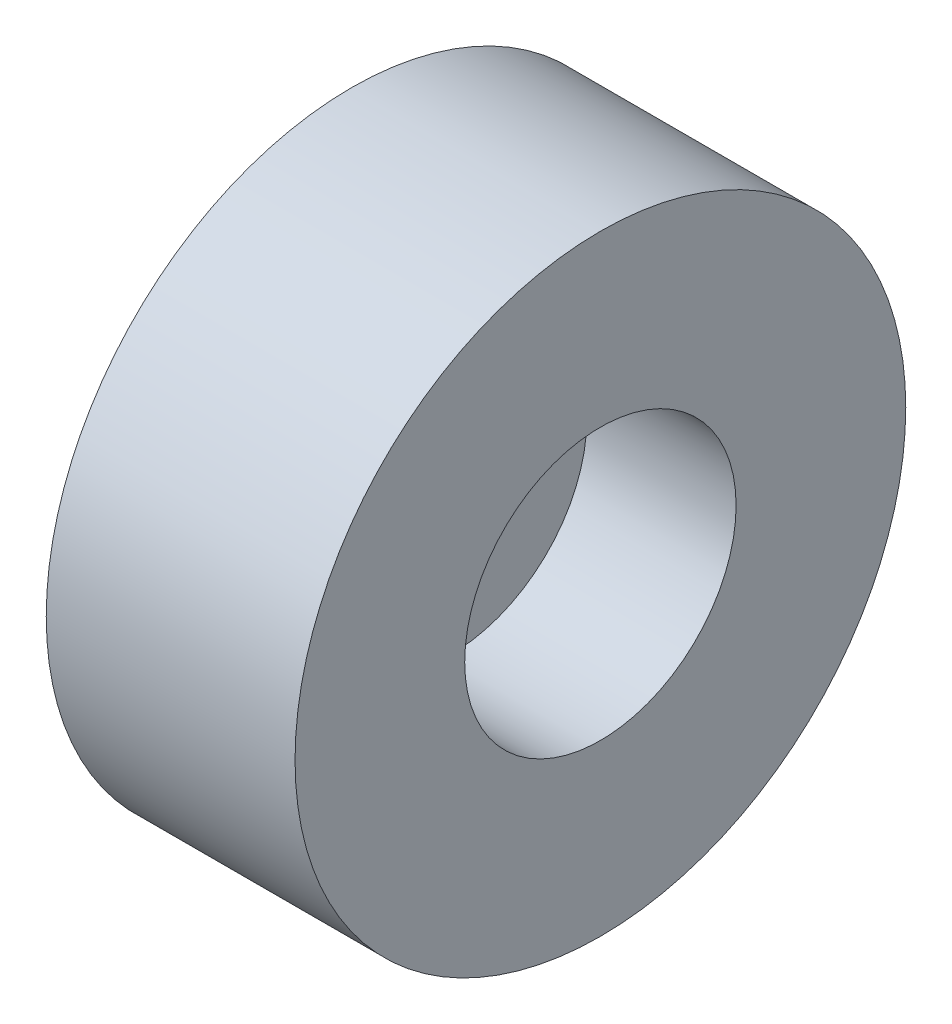
ISO-10303-21;
HEADER;
FILE_DESCRIPTION(('STEP AP214'),'2;1');
FILE_NAME('part.step','',(''),(''),'','','');
FILE_SCHEMA(('AUTOMOTIVE_DESIGN { 1 0 10303 214 1 1 1 1 }'));
ENDSEC;
DATA;
#1=APPLICATION_CONTEXT('core data for automotive mechanical design processes');
#2=APPLICATION_PROTOCOL_DEFINITION('international standard','automotive_design',2000,#1);
#3=PRODUCT_CONTEXT('',#1,'mechanical');
#4=PRODUCT('Part','Part','',(#3));
#5=PRODUCT_RELATED_PRODUCT_CATEGORY('part','',(#4));
#6=PRODUCT_DEFINITION_FORMATION('','',#4);
#7=PRODUCT_DEFINITION_CONTEXT('part definition',#1,'design');
#8=PRODUCT_DEFINITION('design','',#6,#7);
#9=PRODUCT_DEFINITION_SHAPE('','',#8);
#10=(LENGTH_UNIT() NAMED_UNIT(*) SI_UNIT(.MILLI.,.METRE.));
#11=(NAMED_UNIT(*) PLANE_ANGLE_UNIT() SI_UNIT($,.RADIAN.));
#12=(NAMED_UNIT(*) SI_UNIT($,.STERADIAN.) SOLID_ANGLE_UNIT());
#13=UNCERTAINTY_MEASURE_WITH_UNIT(LENGTH_MEASURE(1.E-05),#10,'distance_accuracy_value','');
#14=(GEOMETRIC_REPRESENTATION_CONTEXT(3) GLOBAL_UNCERTAINTY_ASSIGNED_CONTEXT((#13)) GLOBAL_UNIT_ASSIGNED_CONTEXT((#10,
#11,#12)) REPRESENTATION_CONTEXT('',''));
#15=CARTESIAN_POINT('',(0.,0.,0.));
#16=DIRECTION('',(0.,0.,1.));
#17=DIRECTION('',(1.,0.,0.));
#18=AXIS2_PLACEMENT_3D('',#15,#16,#17);
#19=CARTESIAN_POINT('',(5.5,0.,0.));
#20=DIRECTION('',(-1.,0.,0.));
#21=DIRECTION('',(0.,0.,1.));
#22=AXIS2_PLACEMENT_3D('',#19,#20,#21);
#23=CYLINDRICAL_SURFACE('',#22,6.75);
#24=CARTESIAN_POINT('',(5.5,0.,0.));
#25=DIRECTION('',(1.,0.,0.));
#26=DIRECTION('',(0.,0.,-1.));
#27=AXIS2_PLACEMENT_3D('',#24,#25,#26);
#28=CIRCLE('',#27,6.75);
#29=CARTESIAN_POINT('',(5.5,0.,-6.75));
#30=VERTEX_POINT('',#29);
#31=EDGE_CURVE('E10',#30,#30,#28,.T.);
#32=ORIENTED_EDGE('',*,*,#31,.F.);
#33=EDGE_LOOP('',(#32));
#34=FACE_BOUND('',#33,.T.);
#35=CARTESIAN_POINT('',(0.,0.,0.));
#36=DIRECTION('',(1.,0.,0.));
#37=DIRECTION('',(0.,0.,-1.));
#38=AXIS2_PLACEMENT_3D('',#35,#36,#37);
#39=CIRCLE('',#38,6.75);
#40=CARTESIAN_POINT('',(0.,0.,-6.75));
#41=VERTEX_POINT('',#40);
#42=EDGE_CURVE('E45',#41,#41,#39,.T.);
#43=ORIENTED_EDGE('',*,*,#42,.T.);
#44=EDGE_LOOP('',(#43));
#45=FACE_BOUND('',#44,.T.);
#46=ADVANCED_FACE('F37',(#34,#45),#23,.T.);
#47=CARTESIAN_POINT('',(5.5,0.,0.));
#48=DIRECTION('',(1.,0.,0.));
#49=DIRECTION('',(0.,0.,-1.));
#50=AXIS2_PLACEMENT_3D('',#47,#48,#49);
#51=PLANE('',#50);
#52=CARTESIAN_POINT('',(5.5,0.,0.));
#53=DIRECTION('',(1.,0.,0.));
#54=DIRECTION('',(0.,0.,-1.));
#55=AXIS2_PLACEMENT_3D('',#52,#53,#54);
#56=CIRCLE('',#55,3.);
#57=CARTESIAN_POINT('',(5.5,0.,-3.));
#58=VERTEX_POINT('',#57);
#59=EDGE_CURVE('E53',#58,#58,#56,.T.);
#60=ORIENTED_EDGE('',*,*,#59,.F.);
#61=EDGE_LOOP('',(#60));
#62=FACE_BOUND('',#61,.T.);
#63=ORIENTED_EDGE('',*,*,#31,.T.);
#64=EDGE_LOOP('',(#63));
#65=FACE_BOUND('',#64,.T.);
#66=ADVANCED_FACE('F83',(#62,#65),#51,.T.);
#67=CARTESIAN_POINT('',(0.,0.,0.));
#68=DIRECTION('',(1.,0.,0.));
#69=DIRECTION('',(0.,0.,-1.));
#70=AXIS2_PLACEMENT_3D('',#67,#68,#69);
#71=PLANE('',#70);
#72=CARTESIAN_POINT('',(0.,0.,0.));
#73=DIRECTION('',(1.,0.,0.));
#74=DIRECTION('',(0.,0.,-1.));
#75=AXIS2_PLACEMENT_3D('',#72,#73,#74);
#76=CIRCLE('',#75,1.5);
#77=CARTESIAN_POINT('',(0.,0.,-1.5));
#78=VERTEX_POINT('',#77);
#79=EDGE_CURVE('E40',#78,#78,#76,.T.);
#80=ORIENTED_EDGE('',*,*,#79,.T.);
#81=EDGE_LOOP('',(#80));
#82=FACE_BOUND('',#81,.T.);
#83=ORIENTED_EDGE('',*,*,#42,.F.);
#84=EDGE_LOOP('',(#83));
#85=FACE_BOUND('',#84,.T.);
#86=ADVANCED_FACE('F69',(#82,#85),#71,.F.);
#87=CARTESIAN_POINT('',(2.2,0.,0.));
#88=DIRECTION('',(1.,0.,0.));
#89=DIRECTION('',(0.,0.,-1.));
#90=AXIS2_PLACEMENT_3D('',#87,#88,#89);
#91=CYLINDRICAL_SURFACE('',#90,3.);
#92=CARTESIAN_POINT('',(2.2,0.,0.));
#93=DIRECTION('',(1.,0.,0.));
#94=DIRECTION('',(0.,0.,-1.));
#95=AXIS2_PLACEMENT_3D('',#92,#93,#94);
#96=CIRCLE('',#95,3.);
#97=CARTESIAN_POINT('',(2.2,0.,-3.));
#98=VERTEX_POINT('',#97);
#99=EDGE_CURVE('E51',#98,#98,#96,.T.);
#100=ORIENTED_EDGE('',*,*,#99,.F.);
#101=EDGE_LOOP('',(#100));
#102=FACE_BOUND('',#101,.T.);
#103=ORIENTED_EDGE('',*,*,#59,.T.);
#104=EDGE_LOOP('',(#103));
#105=FACE_BOUND('',#104,.T.);
#106=ADVANCED_FACE('F79',(#102,#105),#91,.F.);
#107=CARTESIAN_POINT('',(2.2,0.,0.));
#108=DIRECTION('',(1.,0.,0.));
#109=DIRECTION('',(0.,0.,-1.));
#110=AXIS2_PLACEMENT_3D('',#107,#108,#109);
#111=PLANE('',#110);
#112=CARTESIAN_POINT('',(2.2,0.,0.));
#113=DIRECTION('',(1.,0.,0.));
#114=DIRECTION('',(0.,0.,-1.));
#115=AXIS2_PLACEMENT_3D('',#112,#113,#114);
#116=CIRCLE('',#115,1.5);
#117=CARTESIAN_POINT('',(2.2,0.,-1.5));
#118=VERTEX_POINT('',#117);
#119=EDGE_CURVE('E60',#118,#118,#116,.T.);
#120=ORIENTED_EDGE('',*,*,#119,.F.);
#121=EDGE_LOOP('',(#120));
#122=FACE_BOUND('',#121,.T.);
#123=ORIENTED_EDGE('',*,*,#99,.T.);
#124=EDGE_LOOP('',(#123));
#125=FACE_BOUND('',#124,.T.);
#126=ADVANCED_FACE('F74',(#122,#125),#111,.T.);
#127=CARTESIAN_POINT('',(-1.1,0.,0.));
#128=DIRECTION('',(1.,0.,0.));
#129=DIRECTION('',(0.,0.,-1.));
#130=AXIS2_PLACEMENT_3D('',#127,#128,#129);
#131=CYLINDRICAL_SURFACE('',#130,1.5);
#132=ORIENTED_EDGE('',*,*,#119,.T.);
#133=EDGE_LOOP('',(#132));
#134=FACE_BOUND('',#133,.T.);
#135=ORIENTED_EDGE('',*,*,#79,.F.);
#136=EDGE_LOOP('',(#135));
#137=FACE_BOUND('',#136,.T.);
#138=ADVANCED_FACE('F72',(#134,#137),#131,.F.);
#139=CLOSED_SHELL('',(#46,#66,#86,#106,#126,#138));
#140=MANIFOLD_SOLID_BREP('B2',#139);
#141=ADVANCED_BREP_SHAPE_REPRESENTATION('',(#18,#140),#14);
#142=SHAPE_DEFINITION_REPRESENTATION(#9,#141);
ENDSEC;
END-ISO-10303-21;
